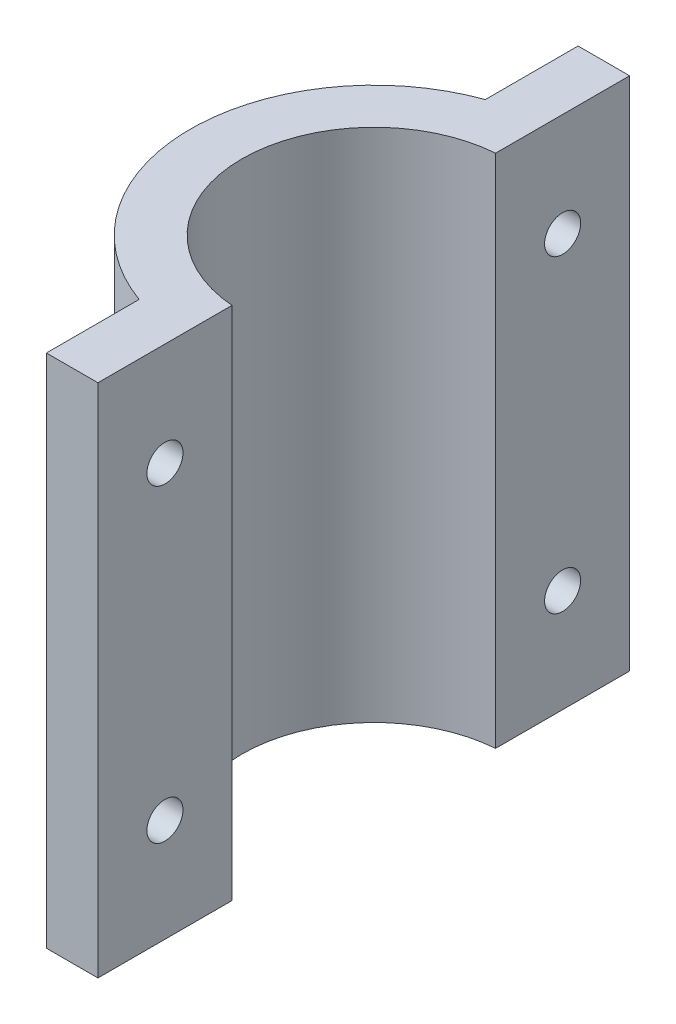
ISO-10303-21;
HEADER;
FILE_DESCRIPTION(('STEP AP214'),'2;1');
FILE_NAME('part.step','',(''),(''),'','','');
FILE_SCHEMA(('AUTOMOTIVE_DESIGN { 1 0 10303 214 1 1 1 1 }'));
ENDSEC;
DATA;
#1=APPLICATION_CONTEXT('core data for automotive mechanical design processes');
#2=APPLICATION_PROTOCOL_DEFINITION('international standard','automotive_design',2000,#1);
#3=PRODUCT_CONTEXT('',#1,'mechanical');
#4=PRODUCT('Part','Part','',(#3));
#5=PRODUCT_RELATED_PRODUCT_CATEGORY('part','',(#4));
#6=PRODUCT_DEFINITION_FORMATION('','',#4);
#7=PRODUCT_DEFINITION_CONTEXT('part definition',#1,'design');
#8=PRODUCT_DEFINITION('design','',#6,#7);
#9=PRODUCT_DEFINITION_SHAPE('','',#8);
#10=(LENGTH_UNIT() NAMED_UNIT(*) SI_UNIT(.MILLI.,.METRE.));
#11=(NAMED_UNIT(*) PLANE_ANGLE_UNIT() SI_UNIT($,.RADIAN.));
#12=(NAMED_UNIT(*) SI_UNIT($,.STERADIAN.) SOLID_ANGLE_UNIT());
#13=UNCERTAINTY_MEASURE_WITH_UNIT(LENGTH_MEASURE(1.E-05),#10,'distance_accuracy_value','');
#14=(GEOMETRIC_REPRESENTATION_CONTEXT(3) GLOBAL_UNCERTAINTY_ASSIGNED_CONTEXT((#13)) GLOBAL_UNIT_ASSIGNED_CONTEXT((#10,
#11,#12)) REPRESENTATION_CONTEXT('',''));
#15=CARTESIAN_POINT('',(0.,0.,0.));
#16=DIRECTION('',(0.,0.,1.));
#17=DIRECTION('',(1.,0.,0.));
#18=AXIS2_PLACEMENT_3D('',#15,#16,#17);
#19=CARTESIAN_POINT('',(-1.,-50.,25.7848331835619));
#20=DIRECTION('',(0.,0.,-1.));
#21=DIRECTION('',(-1.,0.,0.));
#22=AXIS2_PLACEMENT_3D('',#19,#20,#21);
#23=PLANE('',#22);
#24=DIRECTION('',(-1.,0.,0.));
#25=VECTOR('',#24,1.);
#26=CARTESIAN_POINT('',(-1.,0.,25.7848331835619));
#27=LINE('',#26,#25);
#28=CARTESIAN_POINT('',(-1.,0.,25.7848331835619));
#29=VERTEX_POINT('',#28);
#30=CARTESIAN_POINT('',(-6.,0.,25.7848331835619));
#31=VERTEX_POINT('',#30);
#32=EDGE_CURVE('E135',#29,#31,#27,.T.);
#33=ORIENTED_EDGE('',*,*,#32,.T.);
#34=DIRECTION('',(0.,1.,0.));
#35=VECTOR('',#34,1.);
#36=CARTESIAN_POINT('',(-6.,-50.,25.7848331835619));
#37=LINE('',#36,#35);
#38=CARTESIAN_POINT('',(-6.,-50.,25.7848331835619));
#39=VERTEX_POINT('',#38);
#40=EDGE_CURVE('E11',#39,#31,#37,.T.);
#41=ORIENTED_EDGE('',*,*,#40,.F.);
#42=DIRECTION('',(-1.,0.,0.));
#43=VECTOR('',#42,1.);
#44=CARTESIAN_POINT('',(-1.,-50.,25.7848331835619));
#45=LINE('',#44,#43);
#46=CARTESIAN_POINT('',(-1.,-50.,25.7848331835619));
#47=VERTEX_POINT('',#46);
#48=EDGE_CURVE('E150',#47,#39,#45,.T.);
#49=ORIENTED_EDGE('',*,*,#48,.F.);
#50=DIRECTION('',(0.,1.,0.));
#51=VECTOR('',#50,1.);
#52=CARTESIAN_POINT('',(-1.,-50.,25.7848331835619));
#53=LINE('',#52,#51);
#54=EDGE_CURVE('E131',#47,#29,#53,.T.);
#55=ORIENTED_EDGE('',*,*,#54,.T.);
#56=EDGE_LOOP('',(#33,#41,#49,#55));
#57=FACE_BOUND('',#56,.T.);
#58=ADVANCED_FACE('F39',(#57),#23,.F.);
#59=CARTESIAN_POINT('',(-6.,-50.,25.7848331835619));
#60=DIRECTION('',(1.,0.,0.));
#61=DIRECTION('',(0.,0.,-1.));
#62=AXIS2_PLACEMENT_3D('',#59,#60,#61);
#63=PLANE('',#62);
#64=CARTESIAN_POINT('',(-6.,-40.,19.2853936956035));
#65=DIRECTION('',(1.,0.,0.));
#66=DIRECTION('',(0.,0.,-1.));
#67=AXIS2_PLACEMENT_3D('',#64,#65,#66);
#68=CIRCLE('',#67,1.75);
#69=CARTESIAN_POINT('',(-6.,-40.,17.5353936956035));
#70=VERTEX_POINT('',#69);
#71=EDGE_CURVE('E188',#70,#70,#68,.T.);
#72=ORIENTED_EDGE('',*,*,#71,.T.);
#73=EDGE_LOOP('',(#72));
#74=FACE_BOUND('',#73,.T.);
#75=CARTESIAN_POINT('',(-6.,-10.,19.2853936956035));
#76=DIRECTION('',(1.,0.,0.));
#77=DIRECTION('',(0.,0.,-1.));
#78=AXIS2_PLACEMENT_3D('',#75,#76,#77);
#79=CIRCLE('',#78,1.75);
#80=CARTESIAN_POINT('',(-6.,-10.,17.5353936956035));
#81=VERTEX_POINT('',#80);
#82=EDGE_CURVE('E191',#81,#81,#79,.T.);
#83=ORIENTED_EDGE('',*,*,#82,.T.);
#84=EDGE_LOOP('',(#83));
#85=FACE_BOUND('',#84,.T.);
#86=DIRECTION('',(0.,0.,-1.));
#87=VECTOR('',#86,1.);
#88=CARTESIAN_POINT('',(-6.,0.,25.7848331835619));
#89=LINE('',#88,#87);
#90=CARTESIAN_POINT('',(-5.99999999999999,0.,16.7848331835619));
#91=VERTEX_POINT('',#90);
#92=EDGE_CURVE('E138',#31,#91,#89,.T.);
#93=ORIENTED_EDGE('',*,*,#92,.T.);
#94=DIRECTION('',(0.,1.,0.));
#95=VECTOR('',#94,1.);
#96=CARTESIAN_POINT('',(-5.99999999999999,-50.,16.7848331835619));
#97=LINE('',#96,#95);
#98=CARTESIAN_POINT('',(-5.99999999999999,-50.,16.7848331835619));
#99=VERTEX_POINT('',#98);
#100=EDGE_CURVE('E47',#99,#91,#97,.T.);
#101=ORIENTED_EDGE('',*,*,#100,.F.);
#102=DIRECTION('',(0.,0.,-1.));
#103=VECTOR('',#102,1.);
#104=CARTESIAN_POINT('',(-6.,-50.,25.7848331835619));
#105=LINE('',#104,#103);
#106=EDGE_CURVE('E98',#39,#99,#105,.T.);
#107=ORIENTED_EDGE('',*,*,#106,.F.);
#108=ORIENTED_EDGE('',*,*,#40,.T.);
#109=EDGE_LOOP('',(#93,#101,#107,#108));
#110=FACE_BOUND('',#109,.T.);
#111=ADVANCED_FACE('F222',(#74,#85,#110),#63,.F.);
#112=CARTESIAN_POINT('',(0.,-50.,0.));
#113=DIRECTION('',(0.,1.,0.));
#114=DIRECTION('',(0.,0.,1.));
#115=AXIS2_PLACEMENT_3D('',#112,#113,#114);
#116=CYLINDRICAL_SURFACE('',#115,17.825);
#117=CARTESIAN_POINT('',(0.,0.,0.));
#118=DIRECTION('',(0.,-1.,0.));
#119=DIRECTION('',(0.,0.,-1.));
#120=AXIS2_PLACEMENT_3D('',#117,#118,#119);
#121=CIRCLE('',#120,17.825);
#122=CARTESIAN_POINT('',(-6.,0.,-16.7848331835619));
#123=VERTEX_POINT('',#122);
#124=EDGE_CURVE('E141',#91,#123,#121,.T.);
#125=ORIENTED_EDGE('',*,*,#124,.T.);
#126=DIRECTION('',(0.,1.,0.));
#127=VECTOR('',#126,1.);
#128=CARTESIAN_POINT('',(-6.,-50.,-16.7848331835619));
#129=LINE('',#128,#127);
#130=CARTESIAN_POINT('',(-6.,-50.,-16.7848331835619));
#131=VERTEX_POINT('',#130);
#132=EDGE_CURVE('E157',#131,#123,#129,.T.);
#133=ORIENTED_EDGE('',*,*,#132,.F.);
#134=CARTESIAN_POINT('',(0.,-50.,0.));
#135=DIRECTION('',(0.,-1.,0.));
#136=DIRECTION('',(0.,0.,-1.));
#137=AXIS2_PLACEMENT_3D('',#134,#135,#136);
#138=CIRCLE('',#137,17.825);
#139=EDGE_CURVE('E165',#99,#131,#138,.T.);
#140=ORIENTED_EDGE('',*,*,#139,.F.);
#141=ORIENTED_EDGE('',*,*,#100,.T.);
#142=EDGE_LOOP('',(#125,#133,#140,#141));
#143=FACE_BOUND('',#142,.T.);
#144=ADVANCED_FACE('F163',(#143),#116,.T.);
#145=CARTESIAN_POINT('',(-6.,-50.,-16.7848331835619));
#146=DIRECTION('',(1.,0.,0.));
#147=DIRECTION('',(0.,0.,-1.));
#148=AXIS2_PLACEMENT_3D('',#145,#146,#147);
#149=PLANE('',#148);
#150=CARTESIAN_POINT('',(-6.,-10.,-19.2853936956035));
#151=DIRECTION('',(1.,0.,0.));
#152=DIRECTION('',(0.,0.,-1.));
#153=AXIS2_PLACEMENT_3D('',#150,#151,#152);
#154=CIRCLE('',#153,1.75000000000001);
#155=CARTESIAN_POINT('',(-6.,-10.,-21.0353936956035));
#156=VERTEX_POINT('',#155);
#157=EDGE_CURVE('E139',#156,#156,#154,.T.);
#158=ORIENTED_EDGE('',*,*,#157,.T.);
#159=EDGE_LOOP('',(#158));
#160=FACE_BOUND('',#159,.T.);
#161=CARTESIAN_POINT('',(-6.,-40.,-19.2853936956035));
#162=DIRECTION('',(1.,0.,0.));
#163=DIRECTION('',(0.,0.,-1.));
#164=AXIS2_PLACEMENT_3D('',#161,#162,#163);
#165=CIRCLE('',#164,1.75000000000001);
#166=CARTESIAN_POINT('',(-6.,-40.,-21.0353936956036));
#167=VERTEX_POINT('',#166);
#168=EDGE_CURVE('E185',#167,#167,#165,.T.);
#169=ORIENTED_EDGE('',*,*,#168,.T.);
#170=EDGE_LOOP('',(#169));
#171=FACE_BOUND('',#170,.T.);
#172=DIRECTION('',(0.,0.,-1.));
#173=VECTOR('',#172,1.);
#174=CARTESIAN_POINT('',(-6.,0.,-16.7848331835619));
#175=LINE('',#174,#173);
#176=CARTESIAN_POINT('',(-6.,0.,-25.7848331835619));
#177=VERTEX_POINT('',#176);
#178=EDGE_CURVE('E143',#123,#177,#175,.T.);
#179=ORIENTED_EDGE('',*,*,#178,.T.);
#180=DIRECTION('',(0.,1.,0.));
#181=VECTOR('',#180,1.);
#182=CARTESIAN_POINT('',(-6.,-50.,-25.7848331835619));
#183=LINE('',#182,#181);
#184=CARTESIAN_POINT('',(-6.,-50.,-25.7848331835619));
#185=VERTEX_POINT('',#184);
#186=EDGE_CURVE('E154',#185,#177,#183,.T.);
#187=ORIENTED_EDGE('',*,*,#186,.F.);
#188=DIRECTION('',(0.,0.,-1.));
#189=VECTOR('',#188,1.);
#190=CARTESIAN_POINT('',(-6.,-50.,-16.7848331835619));
#191=LINE('',#190,#189);
#192=EDGE_CURVE('E177',#131,#185,#191,.T.);
#193=ORIENTED_EDGE('',*,*,#192,.F.);
#194=ORIENTED_EDGE('',*,*,#132,.T.);
#195=EDGE_LOOP('',(#179,#187,#193,#194));
#196=FACE_BOUND('',#195,.T.);
#197=ADVANCED_FACE('F173',(#160,#171,#196),#149,.F.);
#198=CARTESIAN_POINT('',(-6.,-50.,-25.7848331835619));
#199=DIRECTION('',(0.,0.,1.));
#200=DIRECTION('',(1.,0.,0.));
#201=AXIS2_PLACEMENT_3D('',#198,#199,#200);
#202=PLANE('',#201);
#203=DIRECTION('',(1.,0.,0.));
#204=VECTOR('',#203,1.);
#205=CARTESIAN_POINT('',(-6.,0.,-25.7848331835619));
#206=LINE('',#205,#204);
#207=CARTESIAN_POINT('',(-1.,0.,-25.7848331835619));
#208=VERTEX_POINT('',#207);
#209=EDGE_CURVE('E145',#177,#208,#206,.T.);
#210=ORIENTED_EDGE('',*,*,#209,.T.);
#211=DIRECTION('',(0.,1.,0.));
#212=VECTOR('',#211,1.);
#213=CARTESIAN_POINT('',(-1.,-50.,-25.7848331835619));
#214=LINE('',#213,#212);
#215=CARTESIAN_POINT('',(-1.,-50.,-25.7848331835619));
#216=VERTEX_POINT('',#215);
#217=EDGE_CURVE('E126',#216,#208,#214,.T.);
#218=ORIENTED_EDGE('',*,*,#217,.F.);
#219=DIRECTION('',(1.,0.,0.));
#220=VECTOR('',#219,1.);
#221=CARTESIAN_POINT('',(-6.,-50.,-25.7848331835619));
#222=LINE('',#221,#220);
#223=EDGE_CURVE('E117',#185,#216,#222,.T.);
#224=ORIENTED_EDGE('',*,*,#223,.F.);
#225=ORIENTED_EDGE('',*,*,#186,.T.);
#226=EDGE_LOOP('',(#210,#218,#224,#225));
#227=FACE_BOUND('',#226,.T.);
#228=ADVANCED_FACE('F176',(#227),#202,.F.);
#229=CARTESIAN_POINT('',(-1.,-50.,-25.7848331835619));
#230=DIRECTION('',(-1.,0.,0.));
#231=DIRECTION('',(0.,0.,1.));
#232=AXIS2_PLACEMENT_3D('',#229,#230,#231);
#233=PLANE('',#232);
#234=CARTESIAN_POINT('',(-1.,-10.,-19.2853936956035));
#235=DIRECTION('',(1.,0.,0.));
#236=DIRECTION('',(0.,0.,1.));
#237=AXIS2_PLACEMENT_3D('',#234,#235,#236);
#238=CIRCLE('',#237,1.75000000000001);
#239=CARTESIAN_POINT('',(-1.,-10.,-17.5353936956035));
#240=VERTEX_POINT('',#239);
#241=EDGE_CURVE('E198',#240,#240,#238,.T.);
#242=ORIENTED_EDGE('',*,*,#241,.F.);
#243=EDGE_LOOP('',(#242));
#244=FACE_BOUND('',#243,.T.);
#245=CARTESIAN_POINT('',(-1.,-40.,-19.2853936956035));
#246=DIRECTION('',(1.,0.,0.));
#247=DIRECTION('',(0.,0.,-1.));
#248=AXIS2_PLACEMENT_3D('',#245,#246,#247);
#249=CIRCLE('',#248,1.75000000000001);
#250=CARTESIAN_POINT('',(-1.,-40.,-21.0353936956036));
#251=VERTEX_POINT('',#250);
#252=EDGE_CURVE('E201',#251,#251,#249,.T.);
#253=ORIENTED_EDGE('',*,*,#252,.F.);
#254=EDGE_LOOP('',(#253));
#255=FACE_BOUND('',#254,.T.);
#256=DIRECTION('',(0.,0.,1.));
#257=VECTOR('',#256,1.);
#258=CARTESIAN_POINT('',(-1.,0.,-25.7848331835619));
#259=LINE('',#258,#257);
#260=CARTESIAN_POINT('',(-1.00000000000001,0.,-12.7859542076452));
#261=VERTEX_POINT('',#260);
#262=EDGE_CURVE('E125',#208,#261,#259,.T.);
#263=ORIENTED_EDGE('',*,*,#262,.T.);
#264=DIRECTION('',(0.,1.,0.));
#265=VECTOR('',#264,1.);
#266=CARTESIAN_POINT('',(-1.00000000000001,-50.,-12.7859542076452));
#267=LINE('',#266,#265);
#268=CARTESIAN_POINT('',(-1.00000000000001,-50.,-12.7859542076452));
#269=VERTEX_POINT('',#268);
#270=EDGE_CURVE('E122',#269,#261,#267,.T.);
#271=ORIENTED_EDGE('',*,*,#270,.F.);
#272=DIRECTION('',(0.,0.,1.));
#273=VECTOR('',#272,1.);
#274=CARTESIAN_POINT('',(-1.,-50.,-25.7848331835619));
#275=LINE('',#274,#273);
#276=EDGE_CURVE('E111',#216,#269,#275,.T.);
#277=ORIENTED_EDGE('',*,*,#276,.F.);
#278=ORIENTED_EDGE('',*,*,#217,.T.);
#279=EDGE_LOOP('',(#263,#271,#277,#278));
#280=FACE_BOUND('',#279,.T.);
#281=ADVANCED_FACE('F123',(#244,#255,#280),#233,.F.);
#282=CARTESIAN_POINT('',(0.,-50.,0.));
#283=DIRECTION('',(0.,1.,0.));
#284=DIRECTION('',(0.,0.,1.));
#285=AXIS2_PLACEMENT_3D('',#282,#283,#284);
#286=CYLINDRICAL_SURFACE('',#285,12.825);
#287=CARTESIAN_POINT('',(0.,0.,0.));
#288=DIRECTION('',(0.,1.,0.));
#289=DIRECTION('',(0.,0.,-1.));
#290=AXIS2_PLACEMENT_3D('',#287,#288,#289);
#291=CIRCLE('',#290,12.825);
#292=CARTESIAN_POINT('',(-1.,0.,12.7859542076452));
#293=VERTEX_POINT('',#292);
#294=EDGE_CURVE('E84',#261,#293,#291,.T.);
#295=ORIENTED_EDGE('',*,*,#294,.T.);
#296=DIRECTION('',(0.,1.,0.));
#297=VECTOR('',#296,1.);
#298=CARTESIAN_POINT('',(-1.,-50.,12.7859542076452));
#299=LINE('',#298,#297);
#300=CARTESIAN_POINT('',(-1.,-50.,12.7859542076452));
#301=VERTEX_POINT('',#300);
#302=EDGE_CURVE('E127',#301,#293,#299,.T.);
#303=ORIENTED_EDGE('',*,*,#302,.F.);
#304=CARTESIAN_POINT('',(0.,-50.,0.));
#305=DIRECTION('',(0.,1.,0.));
#306=DIRECTION('',(0.,0.,-1.));
#307=AXIS2_PLACEMENT_3D('',#304,#305,#306);
#308=CIRCLE('',#307,12.825);
#309=EDGE_CURVE('E115',#269,#301,#308,.T.);
#310=ORIENTED_EDGE('',*,*,#309,.F.);
#311=ORIENTED_EDGE('',*,*,#270,.T.);
#312=EDGE_LOOP('',(#295,#303,#310,#311));
#313=FACE_BOUND('',#312,.T.);
#314=ADVANCED_FACE('F129',(#313),#286,.F.);
#315=CARTESIAN_POINT('',(-1.,-50.,25.7848331835619));
#316=DIRECTION('',(-1.,0.,0.));
#317=DIRECTION('',(0.,0.,1.));
#318=AXIS2_PLACEMENT_3D('',#315,#316,#317);
#319=PLANE('',#318);
#320=CARTESIAN_POINT('',(-1.,-40.,19.2853936956035));
#321=DIRECTION('',(1.,0.,0.));
#322=DIRECTION('',(0.,0.,1.));
#323=AXIS2_PLACEMENT_3D('',#320,#321,#322);
#324=CIRCLE('',#323,1.75);
#325=CARTESIAN_POINT('',(-1.,-40.,21.0353936956035));
#326=VERTEX_POINT('',#325);
#327=EDGE_CURVE('E197',#326,#326,#324,.T.);
#328=ORIENTED_EDGE('',*,*,#327,.F.);
#329=EDGE_LOOP('',(#328));
#330=FACE_BOUND('',#329,.T.);
#331=CARTESIAN_POINT('',(-1.,-10.,19.2853936956035));
#332=DIRECTION('',(1.,0.,0.));
#333=DIRECTION('',(0.,0.,-1.));
#334=AXIS2_PLACEMENT_3D('',#331,#332,#333);
#335=CIRCLE('',#334,1.75);
#336=CARTESIAN_POINT('',(-1.,-10.,17.5353936956035));
#337=VERTEX_POINT('',#336);
#338=EDGE_CURVE('E194',#337,#337,#335,.T.);
#339=ORIENTED_EDGE('',*,*,#338,.F.);
#340=EDGE_LOOP('',(#339));
#341=FACE_BOUND('',#340,.T.);
#342=DIRECTION('',(0.,0.,1.));
#343=VECTOR('',#342,1.);
#344=CARTESIAN_POINT('',(-1.,0.,25.7848331835619));
#345=LINE('',#344,#343);
#346=EDGE_CURVE('E90',#293,#29,#345,.T.);
#347=ORIENTED_EDGE('',*,*,#346,.T.);
#348=ORIENTED_EDGE('',*,*,#54,.F.);
#349=DIRECTION('',(0.,0.,1.));
#350=VECTOR('',#349,1.);
#351=CARTESIAN_POINT('',(-1.,-50.,25.7848331835619));
#352=LINE('',#351,#350);
#353=EDGE_CURVE('E55',#301,#47,#352,.T.);
#354=ORIENTED_EDGE('',*,*,#353,.F.);
#355=ORIENTED_EDGE('',*,*,#302,.T.);
#356=EDGE_LOOP('',(#347,#348,#354,#355));
#357=FACE_BOUND('',#356,.T.);
#358=ADVANCED_FACE('F210',(#330,#341,#357),#319,.F.);
#359=CARTESIAN_POINT('',(0.,-50.,0.));
#360=DIRECTION('',(0.,-1.,0.));
#361=DIRECTION('',(0.,0.,-1.));
#362=AXIS2_PLACEMENT_3D('',#359,#360,#361);
#363=PLANE('',#362);
#364=ORIENTED_EDGE('',*,*,#48,.T.);
#365=ORIENTED_EDGE('',*,*,#106,.T.);
#366=ORIENTED_EDGE('',*,*,#139,.T.);
#367=ORIENTED_EDGE('',*,*,#192,.T.);
#368=ORIENTED_EDGE('',*,*,#223,.T.);
#369=ORIENTED_EDGE('',*,*,#276,.T.);
#370=ORIENTED_EDGE('',*,*,#309,.T.);
#371=ORIENTED_EDGE('',*,*,#353,.T.);
#372=EDGE_LOOP('',(#364,#365,#366,#367,#368,#369,#370,#371));
#373=FACE_BOUND('',#372,.T.);
#374=ADVANCED_FACE('F113',(#373),#363,.T.);
#375=CARTESIAN_POINT('',(0.,0.,0.));
#376=DIRECTION('',(0.,-1.,0.));
#377=DIRECTION('',(0.,0.,-1.));
#378=AXIS2_PLACEMENT_3D('',#375,#376,#377);
#379=PLANE('',#378);
#380=ORIENTED_EDGE('',*,*,#32,.F.);
#381=ORIENTED_EDGE('',*,*,#346,.F.);
#382=ORIENTED_EDGE('',*,*,#294,.F.);
#383=ORIENTED_EDGE('',*,*,#262,.F.);
#384=ORIENTED_EDGE('',*,*,#209,.F.);
#385=ORIENTED_EDGE('',*,*,#178,.F.);
#386=ORIENTED_EDGE('',*,*,#124,.F.);
#387=ORIENTED_EDGE('',*,*,#92,.F.);
#388=EDGE_LOOP('',(#380,#381,#382,#383,#384,#385,#386,#387));
#389=FACE_BOUND('',#388,.T.);
#390=ADVANCED_FACE('F169',(#389),#379,.F.);
#391=CARTESIAN_POINT('',(-17.825,-10.,19.2853936956035));
#392=DIRECTION('',(1.,0.,0.));
#393=DIRECTION('',(0.,0.,-1.));
#394=AXIS2_PLACEMENT_3D('',#391,#392,#393);
#395=CYLINDRICAL_SURFACE('',#394,1.75);
#396=ORIENTED_EDGE('',*,*,#338,.T.);
#397=EDGE_LOOP('',(#396));
#398=FACE_BOUND('',#397,.T.);
#399=ORIENTED_EDGE('',*,*,#82,.F.);
#400=EDGE_LOOP('',(#399));
#401=FACE_BOUND('',#400,.T.);
#402=ADVANCED_FACE('F216',(#398,#401),#395,.F.);
#403=CARTESIAN_POINT('',(-17.825,-40.,19.2853936956035));
#404=DIRECTION('',(1.,0.,0.));
#405=DIRECTION('',(0.,0.,-1.));
#406=AXIS2_PLACEMENT_3D('',#403,#404,#405);
#407=CYLINDRICAL_SURFACE('',#406,1.75);
#408=ORIENTED_EDGE('',*,*,#327,.T.);
#409=EDGE_LOOP('',(#408));
#410=FACE_BOUND('',#409,.T.);
#411=ORIENTED_EDGE('',*,*,#71,.F.);
#412=EDGE_LOOP('',(#411));
#413=FACE_BOUND('',#412,.T.);
#414=ADVANCED_FACE('F207',(#410,#413),#407,.F.);
#415=CARTESIAN_POINT('',(-17.825,-40.,-19.2853936956035));
#416=DIRECTION('',(1.,0.,0.));
#417=DIRECTION('',(0.,0.,-1.));
#418=AXIS2_PLACEMENT_3D('',#415,#416,#417);
#419=CYLINDRICAL_SURFACE('',#418,1.75000000000001);
#420=ORIENTED_EDGE('',*,*,#252,.T.);
#421=EDGE_LOOP('',(#420));
#422=FACE_BOUND('',#421,.T.);
#423=ORIENTED_EDGE('',*,*,#168,.F.);
#424=EDGE_LOOP('',(#423));
#425=FACE_BOUND('',#424,.T.);
#426=ADVANCED_FACE('F304',(#422,#425),#419,.F.);
#427=CARTESIAN_POINT('',(-17.825,-10.,-19.2853936956035));
#428=DIRECTION('',(1.,0.,0.));
#429=DIRECTION('',(0.,0.,-1.));
#430=AXIS2_PLACEMENT_3D('',#427,#428,#429);
#431=CYLINDRICAL_SURFACE('',#430,1.75000000000001);
#432=ORIENTED_EDGE('',*,*,#241,.T.);
#433=EDGE_LOOP('',(#432));
#434=FACE_BOUND('',#433,.T.);
#435=ORIENTED_EDGE('',*,*,#157,.F.);
#436=EDGE_LOOP('',(#435));
#437=FACE_BOUND('',#436,.T.);
#438=ADVANCED_FACE('F312',(#434,#437),#431,.F.);
#439=CLOSED_SHELL('',(#58,#111,#144,#197,#228,#281,#314,#358,#374,#390,#402,#414,#426,#438));
#440=MANIFOLD_SOLID_BREP('B2',#439);
#441=ADVANCED_BREP_SHAPE_REPRESENTATION('',(#18,#440),#14);
#442=SHAPE_DEFINITION_REPRESENTATION(#9,#441);
ENDSEC;
END-ISO-10303-21;
